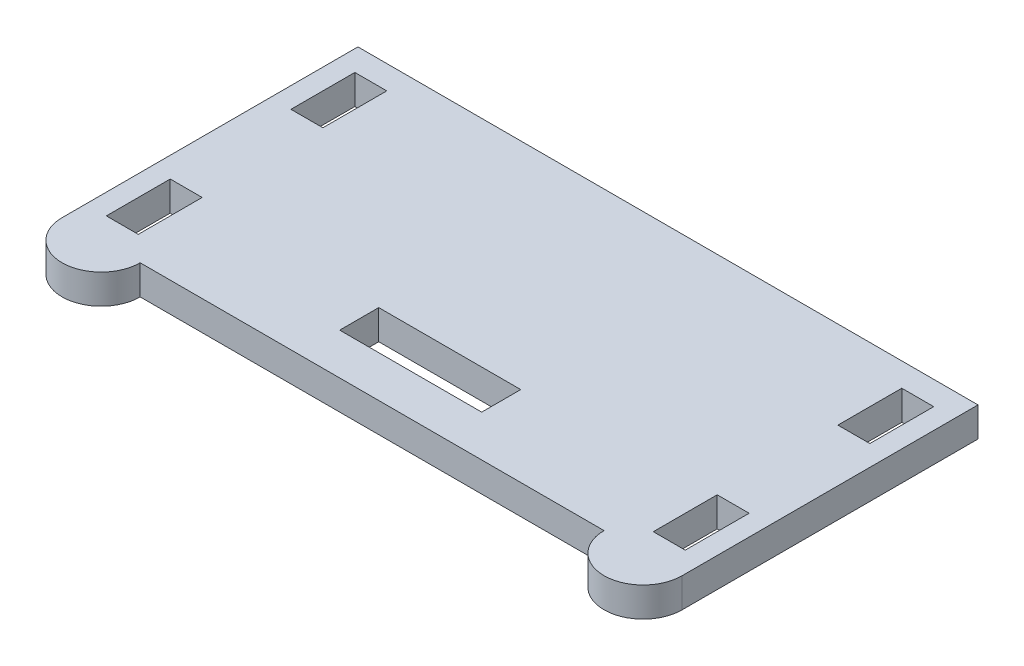
ISO-10303-21;
HEADER;
FILE_DESCRIPTION(('STEP AP214'),'2;1');
FILE_NAME('part.step','',(''),(''),'','','');
FILE_SCHEMA(('AUTOMOTIVE_DESIGN { 1 0 10303 214 1 1 1 1 }'));
ENDSEC;
DATA;
#1=APPLICATION_CONTEXT('core data for automotive mechanical design processes');
#2=APPLICATION_PROTOCOL_DEFINITION('international standard','automotive_design',2000,#1);
#3=PRODUCT_CONTEXT('',#1,'mechanical');
#4=PRODUCT('Part','Part','',(#3));
#5=PRODUCT_RELATED_PRODUCT_CATEGORY('part','',(#4));
#6=PRODUCT_DEFINITION_FORMATION('','',#4);
#7=PRODUCT_DEFINITION_CONTEXT('part definition',#1,'design');
#8=PRODUCT_DEFINITION('design','',#6,#7);
#9=PRODUCT_DEFINITION_SHAPE('','',#8);
#10=(LENGTH_UNIT() NAMED_UNIT(*) SI_UNIT(.MILLI.,.METRE.));
#11=(NAMED_UNIT(*) PLANE_ANGLE_UNIT() SI_UNIT($,.RADIAN.));
#12=(NAMED_UNIT(*) SI_UNIT($,.STERADIAN.) SOLID_ANGLE_UNIT());
#13=UNCERTAINTY_MEASURE_WITH_UNIT(LENGTH_MEASURE(1.E-05),#10,'distance_accuracy_value','');
#14=(GEOMETRIC_REPRESENTATION_CONTEXT(3) GLOBAL_UNCERTAINTY_ASSIGNED_CONTEXT((#13)) GLOBAL_UNIT_ASSIGNED_CONTEXT((#10,
#11,#12)) REPRESENTATION_CONTEXT('',''));
#15=CARTESIAN_POINT('',(0.,0.,0.));
#16=DIRECTION('',(0.,0.,1.));
#17=DIRECTION('',(1.,0.,0.));
#18=AXIS2_PLACEMENT_3D('',#15,#16,#17);
#19=CARTESIAN_POINT('',(-29.083,3.175,15.875));
#20=DIRECTION('',(0.,-1.,0.));
#21=DIRECTION('',(0.,0.,-1.));
#22=AXIS2_PLACEMENT_3D('',#19,#20,#21);
#23=PLANE('',#22);
#24=DIRECTION('',(-1.,0.,0.));
#25=VECTOR('',#24,1.);
#26=CARTESIAN_POINT('',(-31.0642,3.175,-13.335));
#27=LINE('',#26,#25);
#28=CARTESIAN_POINT('',(-27.6352,3.175,-13.335));
#29=VERTEX_POINT('',#28);
#30=CARTESIAN_POINT('',(-31.0642,3.175,-13.335));
#31=VERTEX_POINT('',#30);
#32=EDGE_CURVE('E241',#29,#31,#27,.T.);
#33=ORIENTED_EDGE('',*,*,#32,.F.);
#34=DIRECTION('',(0.,0.,-1.));
#35=VECTOR('',#34,1.);
#36=CARTESIAN_POINT('',(-27.6352,3.175,-13.335));
#37=LINE('',#36,#35);
#38=CARTESIAN_POINT('',(-27.6352,3.175,-6.47699999999999));
#39=VERTEX_POINT('',#38);
#40=EDGE_CURVE('E249',#39,#29,#37,.T.);
#41=ORIENTED_EDGE('',*,*,#40,.F.);
#42=DIRECTION('',(1.,0.,0.));
#43=VECTOR('',#42,1.);
#44=CARTESIAN_POINT('',(-31.0642,3.175,-6.47699999999998));
#45=LINE('',#44,#43);
#46=CARTESIAN_POINT('',(-31.0642,3.175,-6.47699999999998));
#47=VERTEX_POINT('',#46);
#48=EDGE_CURVE('E246',#47,#39,#45,.T.);
#49=ORIENTED_EDGE('',*,*,#48,.F.);
#50=DIRECTION('',(0.,0.,1.));
#51=VECTOR('',#50,1.);
#52=CARTESIAN_POINT('',(-31.0642,3.175,-13.335));
#53=LINE('',#52,#51);
#54=EDGE_CURVE('E243',#31,#47,#53,.T.);
#55=ORIENTED_EDGE('',*,*,#54,.F.);
#56=EDGE_LOOP('',(#33,#41,#49,#55));
#57=FACE_BOUND('',#56,.T.);
#58=DIRECTION('',(0.,0.,-1.));
#59=VECTOR('',#58,1.);
#60=CARTESIAN_POINT('',(31.0642,3.175,6.477));
#61=LINE('',#60,#59);
#62=CARTESIAN_POINT('',(31.0642,3.175,13.335));
#63=VERTEX_POINT('',#62);
#64=CARTESIAN_POINT('',(31.0642,3.175,6.477));
#65=VERTEX_POINT('',#64);
#66=EDGE_CURVE('E303',#63,#65,#61,.T.);
#67=ORIENTED_EDGE('',*,*,#66,.F.);
#68=DIRECTION('',(1.,0.,0.));
#69=VECTOR('',#68,1.);
#70=CARTESIAN_POINT('',(31.0642,3.175,13.335));
#71=LINE('',#70,#69);
#72=CARTESIAN_POINT('',(27.6352,3.175,13.335));
#73=VERTEX_POINT('',#72);
#74=EDGE_CURVE('E311',#73,#63,#71,.T.);
#75=ORIENTED_EDGE('',*,*,#74,.F.);
#76=DIRECTION('',(0.,0.,1.));
#77=VECTOR('',#76,1.);
#78=CARTESIAN_POINT('',(27.6352,3.175,6.477));
#79=LINE('',#78,#77);
#80=CARTESIAN_POINT('',(27.6352,3.175,6.477));
#81=VERTEX_POINT('',#80);
#82=EDGE_CURVE('E308',#81,#73,#79,.T.);
#83=ORIENTED_EDGE('',*,*,#82,.F.);
#84=DIRECTION('',(-1.,0.,0.));
#85=VECTOR('',#84,1.);
#86=CARTESIAN_POINT('',(31.0642,3.175,6.477));
#87=LINE('',#86,#85);
#88=EDGE_CURVE('E305',#65,#81,#87,.T.);
#89=ORIENTED_EDGE('',*,*,#88,.F.);
#90=EDGE_LOOP('',(#67,#75,#83,#89));
#91=FACE_BOUND('',#90,.T.);
#92=DIRECTION('',(0.,0.,-1.));
#93=VECTOR('',#92,1.);
#94=CARTESIAN_POINT('',(33.274,3.175,15.875));
#95=LINE('',#94,#93);
#96=CARTESIAN_POINT('',(33.274,3.175,15.875));
#97=VERTEX_POINT('',#96);
#98=CARTESIAN_POINT('',(33.274,3.175,-15.875));
#99=VERTEX_POINT('',#98);
#100=EDGE_CURVE('E365',#97,#99,#95,.T.);
#101=ORIENTED_EDGE('',*,*,#100,.T.);
#102=DIRECTION('',(-1.,0.,0.));
#103=VECTOR('',#102,1.);
#104=CARTESIAN_POINT('',(-33.274,3.175,-15.875));
#105=LINE('',#104,#103);
#106=CARTESIAN_POINT('',(-33.274,3.175,-15.875));
#107=VERTEX_POINT('',#106);
#108=EDGE_CURVE('E368',#99,#107,#105,.T.);
#109=ORIENTED_EDGE('',*,*,#108,.T.);
#110=DIRECTION('',(0.,0.,1.));
#111=VECTOR('',#110,1.);
#112=CARTESIAN_POINT('',(-33.274,3.175,15.875));
#113=LINE('',#112,#111);
#114=CARTESIAN_POINT('',(-33.274,3.175,15.875));
#115=VERTEX_POINT('',#114);
#116=EDGE_CURVE('E371',#107,#115,#113,.T.);
#117=ORIENTED_EDGE('',*,*,#116,.T.);
#118=CARTESIAN_POINT('',(-29.083,3.175,15.875));
#119=DIRECTION('',(0.,1.,0.));
#120=DIRECTION('',(0.,0.,-1.));
#121=AXIS2_PLACEMENT_3D('',#118,#119,#120);
#122=CIRCLE('',#121,4.191);
#123=CARTESIAN_POINT('',(-24.892,3.175,15.875));
#124=VERTEX_POINT('',#123);
#125=EDGE_CURVE('E373',#115,#124,#122,.T.);
#126=ORIENTED_EDGE('',*,*,#125,.T.);
#127=DIRECTION('',(1.,0.,0.));
#128=VECTOR('',#127,1.);
#129=CARTESIAN_POINT('',(-24.892,3.175,15.875));
#130=LINE('',#129,#128);
#131=CARTESIAN_POINT('',(24.892,3.175,15.875));
#132=VERTEX_POINT('',#131);
#133=EDGE_CURVE('E375',#124,#132,#130,.T.);
#134=ORIENTED_EDGE('',*,*,#133,.T.);
#135=CARTESIAN_POINT('',(29.083,3.175,15.875));
#136=DIRECTION('',(0.,1.,0.));
#137=DIRECTION('',(0.,0.,1.));
#138=AXIS2_PLACEMENT_3D('',#135,#136,#137);
#139=CIRCLE('',#138,4.19099999999999);
#140=EDGE_CURVE('E377',#132,#97,#139,.T.);
#141=ORIENTED_EDGE('',*,*,#140,.T.);
#142=EDGE_LOOP('',(#101,#109,#117,#126,#134,#141));
#143=FACE_BOUND('',#142,.T.);
#144=DIRECTION('',(0.,0.,-1.));
#145=VECTOR('',#144,1.);
#146=CARTESIAN_POINT('',(31.0642,3.175,-13.335));
#147=LINE('',#146,#145);
#148=CARTESIAN_POINT('',(31.0642,3.175,-6.477));
#149=VERTEX_POINT('',#148);
#150=CARTESIAN_POINT('',(31.0642,3.175,-13.335));
#151=VERTEX_POINT('',#150);
#152=EDGE_CURVE('E334',#149,#151,#147,.T.);
#153=ORIENTED_EDGE('',*,*,#152,.F.);
#154=DIRECTION('',(1.,0.,0.));
#155=VECTOR('',#154,1.);
#156=CARTESIAN_POINT('',(31.0642,3.175,-6.477));
#157=LINE('',#156,#155);
#158=CARTESIAN_POINT('',(27.6352,3.175,-6.477));
#159=VERTEX_POINT('',#158);
#160=EDGE_CURVE('E342',#159,#149,#157,.T.);
#161=ORIENTED_EDGE('',*,*,#160,.F.);
#162=DIRECTION('',(0.,0.,1.));
#163=VECTOR('',#162,1.);
#164=CARTESIAN_POINT('',(27.6352,3.175,-13.335));
#165=LINE('',#164,#163);
#166=CARTESIAN_POINT('',(27.6352,3.175,-13.335));
#167=VERTEX_POINT('',#166);
#168=EDGE_CURVE('E339',#167,#159,#165,.T.);
#169=ORIENTED_EDGE('',*,*,#168,.F.);
#170=DIRECTION('',(-1.,0.,0.));
#171=VECTOR('',#170,1.);
#172=CARTESIAN_POINT('',(31.0642,3.175,-13.335));
#173=LINE('',#172,#171);
#174=EDGE_CURVE('E336',#151,#167,#173,.T.);
#175=ORIENTED_EDGE('',*,*,#174,.F.);
#176=EDGE_LOOP('',(#153,#161,#169,#175));
#177=FACE_BOUND('',#176,.T.);
#178=DIRECTION('',(-1.,0.,0.));
#179=VECTOR('',#178,1.);
#180=CARTESIAN_POINT('',(-31.0642,3.175,6.47700000000002));
#181=LINE('',#180,#179);
#182=CARTESIAN_POINT('',(-27.6352,3.175,6.47700000000002));
#183=VERTEX_POINT('',#182);
#184=CARTESIAN_POINT('',(-31.0642,3.175,6.47700000000002));
#185=VERTEX_POINT('',#184);
#186=EDGE_CURVE('E272',#183,#185,#181,.T.);
#187=ORIENTED_EDGE('',*,*,#186,.F.);
#188=DIRECTION('',(0.,0.,-1.));
#189=VECTOR('',#188,1.);
#190=CARTESIAN_POINT('',(-27.6352,3.175,6.47700000000002));
#191=LINE('',#190,#189);
#192=CARTESIAN_POINT('',(-27.6352,3.175,13.335));
#193=VERTEX_POINT('',#192);
#194=EDGE_CURVE('E280',#193,#183,#191,.T.);
#195=ORIENTED_EDGE('',*,*,#194,.F.);
#196=DIRECTION('',(1.,0.,0.));
#197=VECTOR('',#196,1.);
#198=CARTESIAN_POINT('',(-31.0642,3.175,13.335));
#199=LINE('',#198,#197);
#200=CARTESIAN_POINT('',(-31.0642,3.175,13.335));
#201=VERTEX_POINT('',#200);
#202=EDGE_CURVE('E277',#201,#193,#199,.T.);
#203=ORIENTED_EDGE('',*,*,#202,.F.);
#204=DIRECTION('',(0.,0.,1.));
#205=VECTOR('',#204,1.);
#206=CARTESIAN_POINT('',(-31.0642,3.175,6.47700000000002));
#207=LINE('',#206,#205);
#208=EDGE_CURVE('E274',#185,#201,#207,.T.);
#209=ORIENTED_EDGE('',*,*,#208,.F.);
#210=EDGE_LOOP('',(#187,#195,#203,#209));
#211=FACE_BOUND('',#210,.T.);
#212=DIRECTION('',(0.,0.,1.));
#213=VECTOR('',#212,1.);
#214=CARTESIAN_POINT('',(-7.92479999999999,3.175,11.43));
#215=LINE('',#214,#213);
#216=CARTESIAN_POINT('',(-7.92479999999999,3.175,7.23900000000001));
#217=VERTEX_POINT('',#216);
#218=CARTESIAN_POINT('',(-7.92479999999999,3.175,11.43));
#219=VERTEX_POINT('',#218);
#220=EDGE_CURVE('E205',#217,#219,#215,.T.);
#221=ORIENTED_EDGE('',*,*,#220,.F.);
#222=DIRECTION('',(-1.,0.,0.));
#223=VECTOR('',#222,1.);
#224=CARTESIAN_POINT('',(-7.92479999999999,3.175,7.23900000000001));
#225=LINE('',#224,#223);
#226=CARTESIAN_POINT('',(7.31520000000001,3.175,7.23900000000001));
#227=VERTEX_POINT('',#226);
#228=EDGE_CURVE('E227',#227,#217,#225,.T.);
#229=ORIENTED_EDGE('',*,*,#228,.F.);
#230=DIRECTION('',(0.,0.,-1.));
#231=VECTOR('',#230,1.);
#232=CARTESIAN_POINT('',(7.31520000000001,3.175,11.43));
#233=LINE('',#232,#231);
#234=CARTESIAN_POINT('',(7.31520000000001,3.175,11.43));
#235=VERTEX_POINT('',#234);
#236=EDGE_CURVE('E225',#235,#227,#233,.T.);
#237=ORIENTED_EDGE('',*,*,#236,.F.);
#238=DIRECTION('',(1.,0.,0.));
#239=VECTOR('',#238,1.);
#240=CARTESIAN_POINT('',(-7.92479999999999,3.175,11.43));
#241=LINE('',#240,#239);
#242=EDGE_CURVE('E213',#219,#235,#241,.T.);
#243=ORIENTED_EDGE('',*,*,#242,.F.);
#244=EDGE_LOOP('',(#221,#229,#237,#243));
#245=FACE_BOUND('',#244,.T.);
#246=ADVANCED_FACE('F32',(#57,#91,#143,#177,#211,#245),#23,.F.);
#247=CARTESIAN_POINT('',(-29.083,0.,15.875));
#248=DIRECTION('',(0.,-1.,0.));
#249=DIRECTION('',(0.,0.,-1.));
#250=AXIS2_PLACEMENT_3D('',#247,#248,#249);
#251=PLANE('',#250);
#252=DIRECTION('',(0.,0.,-1.));
#253=VECTOR('',#252,1.);
#254=CARTESIAN_POINT('',(33.274,0.,15.875));
#255=LINE('',#254,#253);
#256=CARTESIAN_POINT('',(33.274,0.,15.875));
#257=VERTEX_POINT('',#256);
#258=CARTESIAN_POINT('',(33.274,0.,-15.875));
#259=VERTEX_POINT('',#258);
#260=EDGE_CURVE('E364',#257,#259,#255,.T.);
#261=ORIENTED_EDGE('',*,*,#260,.F.);
#262=CARTESIAN_POINT('',(29.083,0.,15.875));
#263=DIRECTION('',(0.,1.,0.));
#264=DIRECTION('',(0.,0.,1.));
#265=AXIS2_PLACEMENT_3D('',#262,#263,#264);
#266=CIRCLE('',#265,4.19099999999999);
#267=CARTESIAN_POINT('',(24.892,0.,15.875));
#268=VERTEX_POINT('',#267);
#269=EDGE_CURVE('E369',#268,#257,#266,.T.);
#270=ORIENTED_EDGE('',*,*,#269,.F.);
#271=DIRECTION('',(1.,0.,0.));
#272=VECTOR('',#271,1.);
#273=CARTESIAN_POINT('',(-24.892,0.,15.875));
#274=LINE('',#273,#272);
#275=CARTESIAN_POINT('',(-24.892,0.,15.875));
#276=VERTEX_POINT('',#275);
#277=EDGE_CURVE('E388',#276,#268,#274,.T.);
#278=ORIENTED_EDGE('',*,*,#277,.F.);
#279=CARTESIAN_POINT('',(-29.083,0.,15.875));
#280=DIRECTION('',(0.,1.,0.));
#281=DIRECTION('',(0.,0.,-1.));
#282=AXIS2_PLACEMENT_3D('',#279,#280,#281);
#283=CIRCLE('',#282,4.191);
#284=CARTESIAN_POINT('',(-33.274,0.,15.875));
#285=VERTEX_POINT('',#284);
#286=EDGE_CURVE('E386',#285,#276,#283,.T.);
#287=ORIENTED_EDGE('',*,*,#286,.F.);
#288=DIRECTION('',(0.,0.,1.));
#289=VECTOR('',#288,1.);
#290=CARTESIAN_POINT('',(-33.274,0.,15.875));
#291=LINE('',#290,#289);
#292=CARTESIAN_POINT('',(-33.274,0.,-15.875));
#293=VERTEX_POINT('',#292);
#294=EDGE_CURVE('E384',#293,#285,#291,.T.);
#295=ORIENTED_EDGE('',*,*,#294,.F.);
#296=DIRECTION('',(-1.,0.,0.));
#297=VECTOR('',#296,1.);
#298=CARTESIAN_POINT('',(-33.274,0.,-15.875));
#299=LINE('',#298,#297);
#300=EDGE_CURVE('E382',#259,#293,#299,.T.);
#301=ORIENTED_EDGE('',*,*,#300,.F.);
#302=EDGE_LOOP('',(#261,#270,#278,#287,#295,#301));
#303=FACE_BOUND('',#302,.T.);
#304=DIRECTION('',(1.,0.,0.));
#305=VECTOR('',#304,1.);
#306=CARTESIAN_POINT('',(31.0642,0.,-6.477));
#307=LINE('',#306,#305);
#308=CARTESIAN_POINT('',(27.6352,0.,-6.477));
#309=VERTEX_POINT('',#308);
#310=CARTESIAN_POINT('',(31.0642,0.,-6.477));
#311=VERTEX_POINT('',#310);
#312=EDGE_CURVE('E337',#309,#311,#307,.T.);
#313=ORIENTED_EDGE('',*,*,#312,.T.);
#314=DIRECTION('',(0.,0.,-1.));
#315=VECTOR('',#314,1.);
#316=CARTESIAN_POINT('',(31.0642,0.,-13.335));
#317=LINE('',#316,#315);
#318=CARTESIAN_POINT('',(31.0642,0.,-13.335));
#319=VERTEX_POINT('',#318);
#320=EDGE_CURVE('E333',#311,#319,#317,.T.);
#321=ORIENTED_EDGE('',*,*,#320,.T.);
#322=DIRECTION('',(-1.,0.,0.));
#323=VECTOR('',#322,1.);
#324=CARTESIAN_POINT('',(31.0642,0.,-13.335));
#325=LINE('',#324,#323);
#326=CARTESIAN_POINT('',(27.6352,0.,-13.335));
#327=VERTEX_POINT('',#326);
#328=EDGE_CURVE('E347',#319,#327,#325,.T.);
#329=ORIENTED_EDGE('',*,*,#328,.T.);
#330=DIRECTION('',(0.,0.,1.));
#331=VECTOR('',#330,1.);
#332=CARTESIAN_POINT('',(27.6352,0.,-13.335));
#333=LINE('',#332,#331);
#334=EDGE_CURVE('E350',#327,#309,#333,.T.);
#335=ORIENTED_EDGE('',*,*,#334,.T.);
#336=EDGE_LOOP('',(#313,#321,#329,#335));
#337=FACE_BOUND('',#336,.T.);
#338=DIRECTION('',(1.,0.,0.));
#339=VECTOR('',#338,1.);
#340=CARTESIAN_POINT('',(31.0642,0.,13.335));
#341=LINE('',#340,#339);
#342=CARTESIAN_POINT('',(27.6352,0.,13.335));
#343=VERTEX_POINT('',#342);
#344=CARTESIAN_POINT('',(31.0642,0.,13.335));
#345=VERTEX_POINT('',#344);
#346=EDGE_CURVE('E306',#343,#345,#341,.T.);
#347=ORIENTED_EDGE('',*,*,#346,.T.);
#348=DIRECTION('',(0.,0.,-1.));
#349=VECTOR('',#348,1.);
#350=CARTESIAN_POINT('',(31.0642,0.,6.477));
#351=LINE('',#350,#349);
#352=CARTESIAN_POINT('',(31.0642,0.,6.477));
#353=VERTEX_POINT('',#352);
#354=EDGE_CURVE('E302',#345,#353,#351,.T.);
#355=ORIENTED_EDGE('',*,*,#354,.T.);
#356=DIRECTION('',(-1.,0.,0.));
#357=VECTOR('',#356,1.);
#358=CARTESIAN_POINT('',(31.0642,0.,6.477));
#359=LINE('',#358,#357);
#360=CARTESIAN_POINT('',(27.6352,0.,6.477));
#361=VERTEX_POINT('',#360);
#362=EDGE_CURVE('E316',#353,#361,#359,.T.);
#363=ORIENTED_EDGE('',*,*,#362,.T.);
#364=DIRECTION('',(0.,0.,1.));
#365=VECTOR('',#364,1.);
#366=CARTESIAN_POINT('',(27.6352,0.,6.477));
#367=LINE('',#366,#365);
#368=EDGE_CURVE('E319',#361,#343,#367,.T.);
#369=ORIENTED_EDGE('',*,*,#368,.T.);
#370=EDGE_LOOP('',(#347,#355,#363,#369));
#371=FACE_BOUND('',#370,.T.);
#372=DIRECTION('',(0.,0.,-1.));
#373=VECTOR('',#372,1.);
#374=CARTESIAN_POINT('',(-27.6352,0.,6.47700000000002));
#375=LINE('',#374,#373);
#376=CARTESIAN_POINT('',(-27.6352,0.,13.335));
#377=VERTEX_POINT('',#376);
#378=CARTESIAN_POINT('',(-27.6352,0.,6.47700000000002));
#379=VERTEX_POINT('',#378);
#380=EDGE_CURVE('E275',#377,#379,#375,.T.);
#381=ORIENTED_EDGE('',*,*,#380,.T.);
#382=DIRECTION('',(-1.,0.,0.));
#383=VECTOR('',#382,1.);
#384=CARTESIAN_POINT('',(-31.0642,0.,6.47700000000002));
#385=LINE('',#384,#383);
#386=CARTESIAN_POINT('',(-31.0642,0.,6.47700000000002));
#387=VERTEX_POINT('',#386);
#388=EDGE_CURVE('E271',#379,#387,#385,.T.);
#389=ORIENTED_EDGE('',*,*,#388,.T.);
#390=DIRECTION('',(0.,0.,1.));
#391=VECTOR('',#390,1.);
#392=CARTESIAN_POINT('',(-31.0642,0.,6.47700000000002));
#393=LINE('',#392,#391);
#394=CARTESIAN_POINT('',(-31.0642,0.,13.335));
#395=VERTEX_POINT('',#394);
#396=EDGE_CURVE('E285',#387,#395,#393,.T.);
#397=ORIENTED_EDGE('',*,*,#396,.T.);
#398=DIRECTION('',(1.,0.,0.));
#399=VECTOR('',#398,1.);
#400=CARTESIAN_POINT('',(-31.0642,0.,13.335));
#401=LINE('',#400,#399);
#402=EDGE_CURVE('E288',#395,#377,#401,.T.);
#403=ORIENTED_EDGE('',*,*,#402,.T.);
#404=EDGE_LOOP('',(#381,#389,#397,#403));
#405=FACE_BOUND('',#404,.T.);
#406=DIRECTION('',(0.,0.,-1.));
#407=VECTOR('',#406,1.);
#408=CARTESIAN_POINT('',(-27.6352,0.,-13.335));
#409=LINE('',#408,#407);
#410=CARTESIAN_POINT('',(-27.6352,0.,-6.47699999999999));
#411=VERTEX_POINT('',#410);
#412=CARTESIAN_POINT('',(-27.6352,0.,-13.335));
#413=VERTEX_POINT('',#412);
#414=EDGE_CURVE('E244',#411,#413,#409,.T.);
#415=ORIENTED_EDGE('',*,*,#414,.T.);
#416=DIRECTION('',(-1.,0.,0.));
#417=VECTOR('',#416,1.);
#418=CARTESIAN_POINT('',(-31.0642,0.,-13.335));
#419=LINE('',#418,#417);
#420=CARTESIAN_POINT('',(-31.0642,0.,-13.335));
#421=VERTEX_POINT('',#420);
#422=EDGE_CURVE('E221',#413,#421,#419,.T.);
#423=ORIENTED_EDGE('',*,*,#422,.T.);
#424=DIRECTION('',(0.,0.,1.));
#425=VECTOR('',#424,1.);
#426=CARTESIAN_POINT('',(-31.0642,0.,-13.335));
#427=LINE('',#426,#425);
#428=CARTESIAN_POINT('',(-31.0642,0.,-6.47699999999998));
#429=VERTEX_POINT('',#428);
#430=EDGE_CURVE('E254',#421,#429,#427,.T.);
#431=ORIENTED_EDGE('',*,*,#430,.T.);
#432=DIRECTION('',(1.,0.,0.));
#433=VECTOR('',#432,1.);
#434=CARTESIAN_POINT('',(-31.0642,0.,-6.47699999999998));
#435=LINE('',#434,#433);
#436=EDGE_CURVE('E257',#429,#411,#435,.T.);
#437=ORIENTED_EDGE('',*,*,#436,.T.);
#438=EDGE_LOOP('',(#415,#423,#431,#437));
#439=FACE_BOUND('',#438,.T.);
#440=DIRECTION('',(-1.,0.,0.));
#441=VECTOR('',#440,1.);
#442=CARTESIAN_POINT('',(-7.92479999999999,0.,7.23900000000001));
#443=LINE('',#442,#441);
#444=CARTESIAN_POINT('',(7.31520000000001,0.,7.23900000000001));
#445=VERTEX_POINT('',#444);
#446=CARTESIAN_POINT('',(-7.92479999999998,0.,7.23900000000001));
#447=VERTEX_POINT('',#446);
#448=EDGE_CURVE('E214',#445,#447,#443,.T.);
#449=ORIENTED_EDGE('',*,*,#448,.T.);
#450=DIRECTION('',(0.,0.,1.));
#451=VECTOR('',#450,1.);
#452=CARTESIAN_POINT('',(-7.92479999999999,0.,11.43));
#453=LINE('',#452,#451);
#454=CARTESIAN_POINT('',(-7.92479999999999,0.,11.43));
#455=VERTEX_POINT('',#454);
#456=EDGE_CURVE('E55',#447,#455,#453,.T.);
#457=ORIENTED_EDGE('',*,*,#456,.T.);
#458=DIRECTION('',(1.,0.,0.));
#459=VECTOR('',#458,1.);
#460=CARTESIAN_POINT('',(-7.92479999999999,0.,11.43));
#461=LINE('',#460,#459);
#462=CARTESIAN_POINT('',(7.31520000000001,0.,11.43));
#463=VERTEX_POINT('',#462);
#464=EDGE_CURVE('E220',#455,#463,#461,.T.);
#465=ORIENTED_EDGE('',*,*,#464,.T.);
#466=DIRECTION('',(0.,0.,-1.));
#467=VECTOR('',#466,1.);
#468=CARTESIAN_POINT('',(7.31520000000001,0.,11.43));
#469=LINE('',#468,#467);
#470=EDGE_CURVE('E233',#463,#445,#469,.T.);
#471=ORIENTED_EDGE('',*,*,#470,.T.);
#472=EDGE_LOOP('',(#449,#457,#465,#471));
#473=FACE_BOUND('',#472,.T.);
#474=ADVANCED_FACE('F412',(#303,#337,#371,#405,#439,#473),#251,.T.);
#475=CARTESIAN_POINT('',(33.274,3.175,15.875));
#476=DIRECTION('',(-1.,0.,0.));
#477=DIRECTION('',(0.,0.,1.));
#478=AXIS2_PLACEMENT_3D('',#475,#476,#477);
#479=PLANE('',#478);
#480=ORIENTED_EDGE('',*,*,#260,.T.);
#481=DIRECTION('',(0.,-1.,0.));
#482=VECTOR('',#481,1.);
#483=CARTESIAN_POINT('',(33.274,3.175,-15.875));
#484=LINE('',#483,#482);
#485=EDGE_CURVE('E11',#99,#259,#484,.T.);
#486=ORIENTED_EDGE('',*,*,#485,.F.);
#487=ORIENTED_EDGE('',*,*,#100,.F.);
#488=DIRECTION('',(0.,-1.,0.));
#489=VECTOR('',#488,1.);
#490=CARTESIAN_POINT('',(33.274,3.175,15.875));
#491=LINE('',#490,#489);
#492=EDGE_CURVE('E379',#97,#257,#491,.T.);
#493=ORIENTED_EDGE('',*,*,#492,.T.);
#494=EDGE_LOOP('',(#480,#486,#487,#493));
#495=FACE_BOUND('',#494,.T.);
#496=ADVANCED_FACE('F34',(#495),#479,.F.);
#497=CARTESIAN_POINT('',(-33.274,3.175,-15.875));
#498=DIRECTION('',(0.,0.,1.));
#499=DIRECTION('',(1.,0.,0.));
#500=AXIS2_PLACEMENT_3D('',#497,#498,#499);
#501=PLANE('',#500);
#502=ORIENTED_EDGE('',*,*,#300,.T.);
#503=DIRECTION('',(0.,-1.,0.));
#504=VECTOR('',#503,1.);
#505=CARTESIAN_POINT('',(-33.274,3.175,-15.875));
#506=LINE('',#505,#504);
#507=EDGE_CURVE('E40',#107,#293,#506,.T.);
#508=ORIENTED_EDGE('',*,*,#507,.F.);
#509=ORIENTED_EDGE('',*,*,#108,.F.);
#510=ORIENTED_EDGE('',*,*,#485,.T.);
#511=EDGE_LOOP('',(#502,#508,#509,#510));
#512=FACE_BOUND('',#511,.T.);
#513=ADVANCED_FACE('F430',(#512),#501,.F.);
#514=CARTESIAN_POINT('',(-33.274,3.175,15.875));
#515=DIRECTION('',(1.,0.,0.));
#516=DIRECTION('',(0.,0.,-1.));
#517=AXIS2_PLACEMENT_3D('',#514,#515,#516);
#518=PLANE('',#517);
#519=ORIENTED_EDGE('',*,*,#294,.T.);
#520=DIRECTION('',(0.,-1.,0.));
#521=VECTOR('',#520,1.);
#522=CARTESIAN_POINT('',(-33.274,3.175,15.875));
#523=LINE('',#522,#521);
#524=EDGE_CURVE('E399',#115,#285,#523,.T.);
#525=ORIENTED_EDGE('',*,*,#524,.F.);
#526=ORIENTED_EDGE('',*,*,#116,.F.);
#527=ORIENTED_EDGE('',*,*,#507,.T.);
#528=EDGE_LOOP('',(#519,#525,#526,#527));
#529=FACE_BOUND('',#528,.T.);
#530=ADVANCED_FACE('F406',(#529),#518,.F.);
#531=CARTESIAN_POINT('',(-29.083,3.175,15.875));
#532=DIRECTION('',(0.,-1.,0.));
#533=DIRECTION('',(0.,0.,-1.));
#534=AXIS2_PLACEMENT_3D('',#531,#532,#533);
#535=CYLINDRICAL_SURFACE('',#534,4.191);
#536=ORIENTED_EDGE('',*,*,#286,.T.);
#537=DIRECTION('',(0.,-1.,0.));
#538=VECTOR('',#537,1.);
#539=CARTESIAN_POINT('',(-24.892,3.175,15.875));
#540=LINE('',#539,#538);
#541=EDGE_CURVE('E396',#124,#276,#540,.T.);
#542=ORIENTED_EDGE('',*,*,#541,.F.);
#543=ORIENTED_EDGE('',*,*,#125,.F.);
#544=ORIENTED_EDGE('',*,*,#524,.T.);
#545=EDGE_LOOP('',(#536,#542,#543,#544));
#546=FACE_BOUND('',#545,.T.);
#547=ADVANCED_FACE('F418',(#546),#535,.T.);
#548=CARTESIAN_POINT('',(-24.892,3.175,15.875));
#549=DIRECTION('',(0.,0.,-1.));
#550=DIRECTION('',(-1.,0.,0.));
#551=AXIS2_PLACEMENT_3D('',#548,#549,#550);
#552=PLANE('',#551);
#553=ORIENTED_EDGE('',*,*,#277,.T.);
#554=DIRECTION('',(0.,-1.,0.));
#555=VECTOR('',#554,1.);
#556=CARTESIAN_POINT('',(24.892,3.175,15.875));
#557=LINE('',#556,#555);
#558=EDGE_CURVE('E393',#132,#268,#557,.T.);
#559=ORIENTED_EDGE('',*,*,#558,.F.);
#560=ORIENTED_EDGE('',*,*,#133,.F.);
#561=ORIENTED_EDGE('',*,*,#541,.T.);
#562=EDGE_LOOP('',(#553,#559,#560,#561));
#563=FACE_BOUND('',#562,.T.);
#564=ADVANCED_FACE('F422',(#563),#552,.F.);
#565=CARTESIAN_POINT('',(29.083,3.175,15.875));
#566=DIRECTION('',(0.,-1.,0.));
#567=DIRECTION('',(0.,0.,-1.));
#568=AXIS2_PLACEMENT_3D('',#565,#566,#567);
#569=CYLINDRICAL_SURFACE('',#568,4.19099999999999);
#570=ORIENTED_EDGE('',*,*,#269,.T.);
#571=ORIENTED_EDGE('',*,*,#492,.F.);
#572=ORIENTED_EDGE('',*,*,#140,.F.);
#573=ORIENTED_EDGE('',*,*,#558,.T.);
#574=EDGE_LOOP('',(#570,#571,#572,#573));
#575=FACE_BOUND('',#574,.T.);
#576=ADVANCED_FACE('F433',(#575),#569,.T.);
#577=CARTESIAN_POINT('',(31.0642,3.175,-13.335));
#578=DIRECTION('',(-1.,0.,0.));
#579=DIRECTION('',(0.,0.,1.));
#580=AXIS2_PLACEMENT_3D('',#577,#578,#579);
#581=PLANE('',#580);
#582=ORIENTED_EDGE('',*,*,#320,.F.);
#583=DIRECTION('',(0.,-1.,0.));
#584=VECTOR('',#583,1.);
#585=CARTESIAN_POINT('',(31.0642,3.175,-6.477));
#586=LINE('',#585,#584);
#587=EDGE_CURVE('E344',#149,#311,#586,.T.);
#588=ORIENTED_EDGE('',*,*,#587,.F.);
#589=ORIENTED_EDGE('',*,*,#152,.T.);
#590=DIRECTION('',(0.,-1.,0.));
#591=VECTOR('',#590,1.);
#592=CARTESIAN_POINT('',(31.0642,3.175,-13.335));
#593=LINE('',#592,#591);
#594=EDGE_CURVE('E361',#151,#319,#593,.T.);
#595=ORIENTED_EDGE('',*,*,#594,.T.);
#596=EDGE_LOOP('',(#582,#588,#589,#595));
#597=FACE_BOUND('',#596,.T.);
#598=ADVANCED_FACE('F435',(#597),#581,.T.);
#599=CARTESIAN_POINT('',(31.0642,3.175,-13.335));
#600=DIRECTION('',(0.,0.,1.));
#601=DIRECTION('',(1.,0.,0.));
#602=AXIS2_PLACEMENT_3D('',#599,#600,#601);
#603=PLANE('',#602);
#604=ORIENTED_EDGE('',*,*,#328,.F.);
#605=ORIENTED_EDGE('',*,*,#594,.F.);
#606=ORIENTED_EDGE('',*,*,#174,.T.);
#607=DIRECTION('',(0.,-1.,0.));
#608=VECTOR('',#607,1.);
#609=CARTESIAN_POINT('',(27.6352,3.175,-13.335));
#610=LINE('',#609,#608);
#611=EDGE_CURVE('E359',#167,#327,#610,.T.);
#612=ORIENTED_EDGE('',*,*,#611,.T.);
#613=EDGE_LOOP('',(#604,#605,#606,#612));
#614=FACE_BOUND('',#613,.T.);
#615=ADVANCED_FACE('F441',(#614),#603,.T.);
#616=CARTESIAN_POINT('',(27.6352,3.175,-13.335));
#617=DIRECTION('',(1.,0.,0.));
#618=DIRECTION('',(0.,0.,-1.));
#619=AXIS2_PLACEMENT_3D('',#616,#617,#618);
#620=PLANE('',#619);
#621=ORIENTED_EDGE('',*,*,#334,.F.);
#622=ORIENTED_EDGE('',*,*,#611,.F.);
#623=ORIENTED_EDGE('',*,*,#168,.T.);
#624=DIRECTION('',(0.,-1.,0.));
#625=VECTOR('',#624,1.);
#626=CARTESIAN_POINT('',(27.6352,3.175,-6.477));
#627=LINE('',#626,#625);
#628=EDGE_CURVE('E357',#159,#309,#627,.T.);
#629=ORIENTED_EDGE('',*,*,#628,.T.);
#630=EDGE_LOOP('',(#621,#622,#623,#629));
#631=FACE_BOUND('',#630,.T.);
#632=ADVANCED_FACE('F457',(#631),#620,.T.);
#633=CARTESIAN_POINT('',(31.0642,3.175,-6.477));
#634=DIRECTION('',(0.,0.,-1.));
#635=DIRECTION('',(-1.,0.,0.));
#636=AXIS2_PLACEMENT_3D('',#633,#634,#635);
#637=PLANE('',#636);
#638=ORIENTED_EDGE('',*,*,#312,.F.);
#639=ORIENTED_EDGE('',*,*,#628,.F.);
#640=ORIENTED_EDGE('',*,*,#160,.T.);
#641=ORIENTED_EDGE('',*,*,#587,.T.);
#642=EDGE_LOOP('',(#638,#639,#640,#641));
#643=FACE_BOUND('',#642,.T.);
#644=ADVANCED_FACE('F461',(#643),#637,.T.);
#645=CARTESIAN_POINT('',(31.0642,3.175,6.477));
#646=DIRECTION('',(-1.,0.,0.));
#647=DIRECTION('',(0.,0.,1.));
#648=AXIS2_PLACEMENT_3D('',#645,#646,#647);
#649=PLANE('',#648);
#650=ORIENTED_EDGE('',*,*,#354,.F.);
#651=DIRECTION('',(0.,-1.,0.));
#652=VECTOR('',#651,1.);
#653=CARTESIAN_POINT('',(31.0642,3.175,13.335));
#654=LINE('',#653,#652);
#655=EDGE_CURVE('E313',#63,#345,#654,.T.);
#656=ORIENTED_EDGE('',*,*,#655,.F.);
#657=ORIENTED_EDGE('',*,*,#66,.T.);
#658=DIRECTION('',(0.,-1.,0.));
#659=VECTOR('',#658,1.);
#660=CARTESIAN_POINT('',(31.0642,3.175,6.477));
#661=LINE('',#660,#659);
#662=EDGE_CURVE('E330',#65,#353,#661,.T.);
#663=ORIENTED_EDGE('',*,*,#662,.T.);
#664=EDGE_LOOP('',(#650,#656,#657,#663));
#665=FACE_BOUND('',#664,.T.);
#666=ADVANCED_FACE('F465',(#665),#649,.T.);
#667=CARTESIAN_POINT('',(31.0642,3.175,6.477));
#668=DIRECTION('',(0.,0.,1.));
#669=DIRECTION('',(1.,0.,0.));
#670=AXIS2_PLACEMENT_3D('',#667,#668,#669);
#671=PLANE('',#670);
#672=ORIENTED_EDGE('',*,*,#362,.F.);
#673=ORIENTED_EDGE('',*,*,#662,.F.);
#674=ORIENTED_EDGE('',*,*,#88,.T.);
#675=DIRECTION('',(0.,-1.,0.));
#676=VECTOR('',#675,1.);
#677=CARTESIAN_POINT('',(27.6352,3.175,6.477));
#678=LINE('',#677,#676);
#679=EDGE_CURVE('E328',#81,#361,#678,.T.);
#680=ORIENTED_EDGE('',*,*,#679,.T.);
#681=EDGE_LOOP('',(#672,#673,#674,#680));
#682=FACE_BOUND('',#681,.T.);
#683=ADVANCED_FACE('F469',(#682),#671,.T.);
#684=CARTESIAN_POINT('',(27.6352,3.175,6.477));
#685=DIRECTION('',(1.,0.,0.));
#686=DIRECTION('',(0.,0.,-1.));
#687=AXIS2_PLACEMENT_3D('',#684,#685,#686);
#688=PLANE('',#687);
#689=ORIENTED_EDGE('',*,*,#368,.F.);
#690=ORIENTED_EDGE('',*,*,#679,.F.);
#691=ORIENTED_EDGE('',*,*,#82,.T.);
#692=DIRECTION('',(0.,-1.,0.));
#693=VECTOR('',#692,1.);
#694=CARTESIAN_POINT('',(27.6352,3.175,13.335));
#695=LINE('',#694,#693);
#696=EDGE_CURVE('E326',#73,#343,#695,.T.);
#697=ORIENTED_EDGE('',*,*,#696,.T.);
#698=EDGE_LOOP('',(#689,#690,#691,#697));
#699=FACE_BOUND('',#698,.T.);
#700=ADVANCED_FACE('F473',(#699),#688,.T.);
#701=CARTESIAN_POINT('',(31.0642,3.175,13.335));
#702=DIRECTION('',(0.,0.,-1.));
#703=DIRECTION('',(-1.,0.,0.));
#704=AXIS2_PLACEMENT_3D('',#701,#702,#703);
#705=PLANE('',#704);
#706=ORIENTED_EDGE('',*,*,#346,.F.);
#707=ORIENTED_EDGE('',*,*,#696,.F.);
#708=ORIENTED_EDGE('',*,*,#74,.T.);
#709=ORIENTED_EDGE('',*,*,#655,.T.);
#710=EDGE_LOOP('',(#706,#707,#708,#709));
#711=FACE_BOUND('',#710,.T.);
#712=ADVANCED_FACE('F477',(#711),#705,.T.);
#713=CARTESIAN_POINT('',(-31.0642,3.175,6.47700000000002));
#714=DIRECTION('',(0.,0.,1.));
#715=DIRECTION('',(1.,0.,0.));
#716=AXIS2_PLACEMENT_3D('',#713,#714,#715);
#717=PLANE('',#716);
#718=ORIENTED_EDGE('',*,*,#388,.F.);
#719=DIRECTION('',(0.,-1.,0.));
#720=VECTOR('',#719,1.);
#721=CARTESIAN_POINT('',(-27.6352,3.175,6.47700000000002));
#722=LINE('',#721,#720);
#723=EDGE_CURVE('E282',#183,#379,#722,.T.);
#724=ORIENTED_EDGE('',*,*,#723,.F.);
#725=ORIENTED_EDGE('',*,*,#186,.T.);
#726=DIRECTION('',(0.,-1.,0.));
#727=VECTOR('',#726,1.);
#728=CARTESIAN_POINT('',(-31.0642,3.175,6.47700000000002));
#729=LINE('',#728,#727);
#730=EDGE_CURVE('E299',#185,#387,#729,.T.);
#731=ORIENTED_EDGE('',*,*,#730,.T.);
#732=EDGE_LOOP('',(#718,#724,#725,#731));
#733=FACE_BOUND('',#732,.T.);
#734=ADVANCED_FACE('F481',(#733),#717,.T.);
#735=CARTESIAN_POINT('',(-31.0642,3.175,6.47700000000002));
#736=DIRECTION('',(1.,0.,0.));
#737=DIRECTION('',(0.,0.,-1.));
#738=AXIS2_PLACEMENT_3D('',#735,#736,#737);
#739=PLANE('',#738);
#740=ORIENTED_EDGE('',*,*,#396,.F.);
#741=ORIENTED_EDGE('',*,*,#730,.F.);
#742=ORIENTED_EDGE('',*,*,#208,.T.);
#743=DIRECTION('',(0.,-1.,0.));
#744=VECTOR('',#743,1.);
#745=CARTESIAN_POINT('',(-31.0642,3.175,13.335));
#746=LINE('',#745,#744);
#747=EDGE_CURVE('E297',#201,#395,#746,.T.);
#748=ORIENTED_EDGE('',*,*,#747,.T.);
#749=EDGE_LOOP('',(#740,#741,#742,#748));
#750=FACE_BOUND('',#749,.T.);
#751=ADVANCED_FACE('F485',(#750),#739,.T.);
#752=CARTESIAN_POINT('',(-31.0642,3.175,13.335));
#753=DIRECTION('',(0.,0.,-1.));
#754=DIRECTION('',(-1.,0.,0.));
#755=AXIS2_PLACEMENT_3D('',#752,#753,#754);
#756=PLANE('',#755);
#757=ORIENTED_EDGE('',*,*,#402,.F.);
#758=ORIENTED_EDGE('',*,*,#747,.F.);
#759=ORIENTED_EDGE('',*,*,#202,.T.);
#760=DIRECTION('',(0.,-1.,0.));
#761=VECTOR('',#760,1.);
#762=CARTESIAN_POINT('',(-27.6352,3.175,13.335));
#763=LINE('',#762,#761);
#764=EDGE_CURVE('E295',#193,#377,#763,.T.);
#765=ORIENTED_EDGE('',*,*,#764,.T.);
#766=EDGE_LOOP('',(#757,#758,#759,#765));
#767=FACE_BOUND('',#766,.T.);
#768=ADVANCED_FACE('F489',(#767),#756,.T.);
#769=CARTESIAN_POINT('',(-27.6352,3.175,6.47700000000002));
#770=DIRECTION('',(-1.,0.,0.));
#771=DIRECTION('',(0.,0.,1.));
#772=AXIS2_PLACEMENT_3D('',#769,#770,#771);
#773=PLANE('',#772);
#774=ORIENTED_EDGE('',*,*,#380,.F.);
#775=ORIENTED_EDGE('',*,*,#764,.F.);
#776=ORIENTED_EDGE('',*,*,#194,.T.);
#777=ORIENTED_EDGE('',*,*,#723,.T.);
#778=EDGE_LOOP('',(#774,#775,#776,#777));
#779=FACE_BOUND('',#778,.T.);
#780=ADVANCED_FACE('F493',(#779),#773,.T.);
#781=CARTESIAN_POINT('',(-31.0642,3.175,-13.335));
#782=DIRECTION('',(0.,0.,1.));
#783=DIRECTION('',(1.,0.,0.));
#784=AXIS2_PLACEMENT_3D('',#781,#782,#783);
#785=PLANE('',#784);
#786=ORIENTED_EDGE('',*,*,#422,.F.);
#787=DIRECTION('',(0.,-1.,0.));
#788=VECTOR('',#787,1.);
#789=CARTESIAN_POINT('',(-27.6352,3.175,-13.335));
#790=LINE('',#789,#788);
#791=EDGE_CURVE('E251',#29,#413,#790,.T.);
#792=ORIENTED_EDGE('',*,*,#791,.F.);
#793=ORIENTED_EDGE('',*,*,#32,.T.);
#794=DIRECTION('',(0.,-1.,0.));
#795=VECTOR('',#794,1.);
#796=CARTESIAN_POINT('',(-31.0642,3.175,-13.335));
#797=LINE('',#796,#795);
#798=EDGE_CURVE('E268',#31,#421,#797,.T.);
#799=ORIENTED_EDGE('',*,*,#798,.T.);
#800=EDGE_LOOP('',(#786,#792,#793,#799));
#801=FACE_BOUND('',#800,.T.);
#802=ADVANCED_FACE('F497',(#801),#785,.T.);
#803=CARTESIAN_POINT('',(-31.0642,3.175,-13.335));
#804=DIRECTION('',(1.,0.,0.));
#805=DIRECTION('',(0.,0.,-1.));
#806=AXIS2_PLACEMENT_3D('',#803,#804,#805);
#807=PLANE('',#806);
#808=ORIENTED_EDGE('',*,*,#430,.F.);
#809=ORIENTED_EDGE('',*,*,#798,.F.);
#810=ORIENTED_EDGE('',*,*,#54,.T.);
#811=DIRECTION('',(0.,-1.,0.));
#812=VECTOR('',#811,1.);
#813=CARTESIAN_POINT('',(-31.0642,3.175,-6.47699999999998));
#814=LINE('',#813,#812);
#815=EDGE_CURVE('E266',#47,#429,#814,.T.);
#816=ORIENTED_EDGE('',*,*,#815,.T.);
#817=EDGE_LOOP('',(#808,#809,#810,#816));
#818=FACE_BOUND('',#817,.T.);
#819=ADVANCED_FACE('F501',(#818),#807,.T.);
#820=CARTESIAN_POINT('',(-31.0642,3.175,-6.47699999999998));
#821=DIRECTION('',(0.,0.,-1.));
#822=DIRECTION('',(-1.,0.,0.));
#823=AXIS2_PLACEMENT_3D('',#820,#821,#822);
#824=PLANE('',#823);
#825=ORIENTED_EDGE('',*,*,#436,.F.);
#826=ORIENTED_EDGE('',*,*,#815,.F.);
#827=ORIENTED_EDGE('',*,*,#48,.T.);
#828=DIRECTION('',(0.,-1.,0.));
#829=VECTOR('',#828,1.);
#830=CARTESIAN_POINT('',(-27.6352,3.175,-6.47699999999999));
#831=LINE('',#830,#829);
#832=EDGE_CURVE('E264',#39,#411,#831,.T.);
#833=ORIENTED_EDGE('',*,*,#832,.T.);
#834=EDGE_LOOP('',(#825,#826,#827,#833));
#835=FACE_BOUND('',#834,.T.);
#836=ADVANCED_FACE('F505',(#835),#824,.T.);
#837=CARTESIAN_POINT('',(-27.6352,3.175,-13.335));
#838=DIRECTION('',(-1.,0.,0.));
#839=DIRECTION('',(0.,0.,1.));
#840=AXIS2_PLACEMENT_3D('',#837,#838,#839);
#841=PLANE('',#840);
#842=ORIENTED_EDGE('',*,*,#414,.F.);
#843=ORIENTED_EDGE('',*,*,#832,.F.);
#844=ORIENTED_EDGE('',*,*,#40,.T.);
#845=ORIENTED_EDGE('',*,*,#791,.T.);
#846=EDGE_LOOP('',(#842,#843,#844,#845));
#847=FACE_BOUND('',#846,.T.);
#848=ADVANCED_FACE('F509',(#847),#841,.T.);
#849=CARTESIAN_POINT('',(-7.92479999999999,3.175,11.43));
#850=DIRECTION('',(1.,0.,0.));
#851=DIRECTION('',(0.,0.,-1.));
#852=AXIS2_PLACEMENT_3D('',#849,#850,#851);
#853=PLANE('',#852);
#854=ORIENTED_EDGE('',*,*,#456,.F.);
#855=DIRECTION('',(0.,-1.,0.));
#856=VECTOR('',#855,1.);
#857=CARTESIAN_POINT('',(-7.92479999999999,3.175,7.23900000000001));
#858=LINE('',#857,#856);
#859=EDGE_CURVE('E209',#217,#447,#858,.T.);
#860=ORIENTED_EDGE('',*,*,#859,.F.);
#861=ORIENTED_EDGE('',*,*,#220,.T.);
#862=DIRECTION('',(0.,-1.,0.));
#863=VECTOR('',#862,1.);
#864=CARTESIAN_POINT('',(-7.92479999999999,3.175,11.43));
#865=LINE('',#864,#863);
#866=EDGE_CURVE('E208',#219,#455,#865,.T.);
#867=ORIENTED_EDGE('',*,*,#866,.T.);
#868=EDGE_LOOP('',(#854,#860,#861,#867));
#869=FACE_BOUND('',#868,.T.);
#870=ADVANCED_FACE('F207',(#869),#853,.T.);
#871=CARTESIAN_POINT('',(-7.92479999999999,3.175,11.43));
#872=DIRECTION('',(0.,0.,-1.));
#873=DIRECTION('',(-1.,0.,0.));
#874=AXIS2_PLACEMENT_3D('',#871,#872,#873);
#875=PLANE('',#874);
#876=ORIENTED_EDGE('',*,*,#464,.F.);
#877=ORIENTED_EDGE('',*,*,#866,.F.);
#878=ORIENTED_EDGE('',*,*,#242,.T.);
#879=DIRECTION('',(0.,-1.,0.));
#880=VECTOR('',#879,1.);
#881=CARTESIAN_POINT('',(7.31520000000001,3.175,11.43));
#882=LINE('',#881,#880);
#883=EDGE_CURVE('E222',#235,#463,#882,.T.);
#884=ORIENTED_EDGE('',*,*,#883,.T.);
#885=EDGE_LOOP('',(#876,#877,#878,#884));
#886=FACE_BOUND('',#885,.T.);
#887=ADVANCED_FACE('F217',(#886),#875,.T.);
#888=CARTESIAN_POINT('',(7.31520000000001,3.175,11.43));
#889=DIRECTION('',(-1.,0.,0.));
#890=DIRECTION('',(0.,0.,1.));
#891=AXIS2_PLACEMENT_3D('',#888,#889,#890);
#892=PLANE('',#891);
#893=ORIENTED_EDGE('',*,*,#470,.F.);
#894=ORIENTED_EDGE('',*,*,#883,.F.);
#895=ORIENTED_EDGE('',*,*,#236,.T.);
#896=DIRECTION('',(0.,-1.,0.));
#897=VECTOR('',#896,1.);
#898=CARTESIAN_POINT('',(7.31520000000001,3.175,7.23900000000001));
#899=LINE('',#898,#897);
#900=EDGE_CURVE('E47',#227,#445,#899,.T.);
#901=ORIENTED_EDGE('',*,*,#900,.T.);
#902=EDGE_LOOP('',(#893,#894,#895,#901));
#903=FACE_BOUND('',#902,.T.);
#904=ADVANCED_FACE('F518',(#903),#892,.T.);
#905=CARTESIAN_POINT('',(-7.92479999999999,3.175,7.23900000000001));
#906=DIRECTION('',(0.,0.,1.));
#907=DIRECTION('',(1.,0.,0.));
#908=AXIS2_PLACEMENT_3D('',#905,#906,#907);
#909=PLANE('',#908);
#910=ORIENTED_EDGE('',*,*,#448,.F.);
#911=ORIENTED_EDGE('',*,*,#900,.F.);
#912=ORIENTED_EDGE('',*,*,#228,.T.);
#913=ORIENTED_EDGE('',*,*,#859,.T.);
#914=EDGE_LOOP('',(#910,#911,#912,#913));
#915=FACE_BOUND('',#914,.T.);
#916=ADVANCED_FACE('F521',(#915),#909,.T.);
#917=CLOSED_SHELL('',(#246,#474,#496,#513,#530,#547,#564,#576,#598,#615,#632,#644,#666,#683,
#700,#712,#734,#751,#768,#780,#802,#819,#836,#848,#870,#887,#904,#916));
#918=MANIFOLD_SOLID_BREP('B2',#917);
#919=ADVANCED_BREP_SHAPE_REPRESENTATION('',(#18,#918),#14);
#920=SHAPE_DEFINITION_REPRESENTATION(#9,#919);
ENDSEC;
END-ISO-10303-21;
